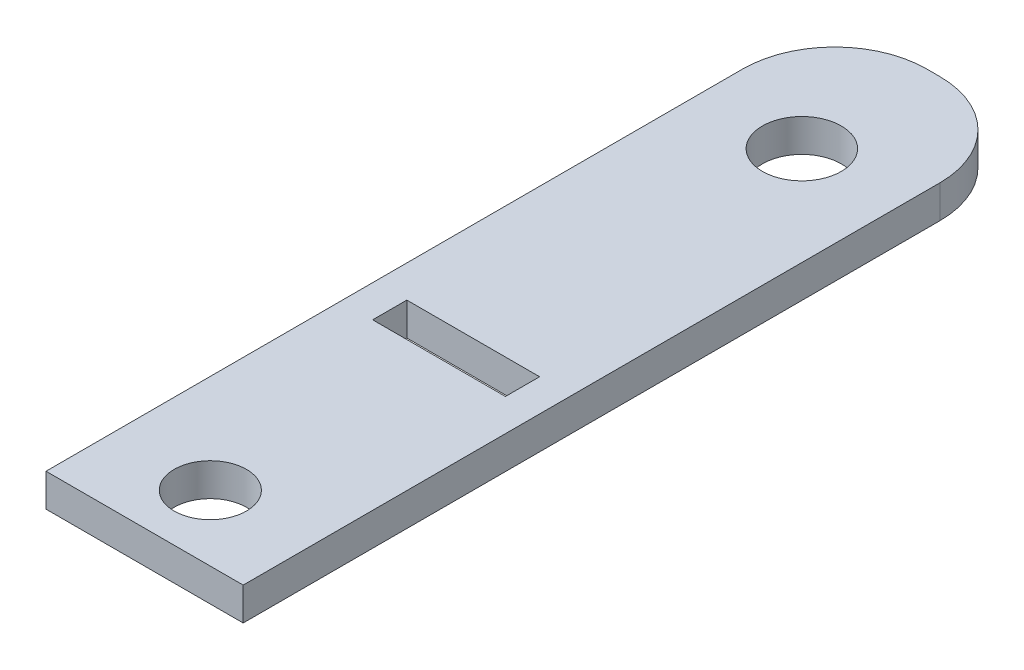
ISO-10303-21;
HEADER;
FILE_DESCRIPTION(('STEP AP214'),'2;1');
FILE_NAME('part.step','',(''),(''),'','','');
FILE_SCHEMA(('AUTOMOTIVE_DESIGN { 1 0 10303 214 1 1 1 1 }'));
ENDSEC;
DATA;
#1=APPLICATION_CONTEXT('core data for automotive mechanical design processes');
#2=APPLICATION_PROTOCOL_DEFINITION('international standard','automotive_design',2000,#1);
#3=PRODUCT_CONTEXT('',#1,'mechanical');
#4=PRODUCT('Part','Part','',(#3));
#5=PRODUCT_RELATED_PRODUCT_CATEGORY('part','',(#4));
#6=PRODUCT_DEFINITION_FORMATION('','',#4);
#7=PRODUCT_DEFINITION_CONTEXT('part definition',#1,'design');
#8=PRODUCT_DEFINITION('design','',#6,#7);
#9=PRODUCT_DEFINITION_SHAPE('','',#8);
#10=(LENGTH_UNIT() NAMED_UNIT(*) SI_UNIT(.MILLI.,.METRE.));
#11=(NAMED_UNIT(*) PLANE_ANGLE_UNIT() SI_UNIT($,.RADIAN.));
#12=(NAMED_UNIT(*) SI_UNIT($,.STERADIAN.) SOLID_ANGLE_UNIT());
#13=UNCERTAINTY_MEASURE_WITH_UNIT(LENGTH_MEASURE(1.E-05),#10,'distance_accuracy_value','');
#14=(GEOMETRIC_REPRESENTATION_CONTEXT(3) GLOBAL_UNCERTAINTY_ASSIGNED_CONTEXT((#13)) GLOBAL_UNIT_ASSIGNED_CONTEXT((#10,
#11,#12)) REPRESENTATION_CONTEXT('',''));
#15=CARTESIAN_POINT('',(0.,0.,0.));
#16=DIRECTION('',(0.,0.,1.));
#17=DIRECTION('',(1.,0.,0.));
#18=AXIS2_PLACEMENT_3D('',#15,#16,#17);
#19=CARTESIAN_POINT('',(-5.52309824012321,-0.0697461828453013,-24.4261845109079));
#20=DIRECTION('',(0.,1.,0.));
#21=DIRECTION('',(0.,0.,1.));
#22=AXIS2_PLACEMENT_3D('',#19,#20,#21);
#23=CYLINDRICAL_SURFACE('',#22,8.89);
#24=DIRECTION('',(0.,1.,0.));
#25=VECTOR('',#24,1.);
#26=CARTESIAN_POINT('',(-5.52309824012321,-0.0697461828453013,-33.3161845109079));
#27=LINE('',#26,#25);
#28=CARTESIAN_POINT('',(-5.52309824012321,-3.2447461828453,-33.3161845109079));
#29=VERTEX_POINT('',#28);
#30=CARTESIAN_POINT('',(-5.52309824012321,-0.0697461828453013,-33.3161845109079));
#31=VERTEX_POINT('',#30);
#32=EDGE_CURVE('E190',#29,#31,#27,.T.);
#33=ORIENTED_EDGE('',*,*,#32,.F.);
#34=CARTESIAN_POINT('',(-5.52309824012321,-3.2447461828453,-24.4261845109079));
#35=DIRECTION('',(0.,1.,0.));
#36=DIRECTION('',(0.,0.,1.));
#37=AXIS2_PLACEMENT_3D('',#34,#35,#36);
#38=CIRCLE('',#37,8.89);
#39=CARTESIAN_POINT('',(-14.4130982401232,-3.2447461828453,-24.4261845109079));
#40=VERTEX_POINT('',#39);
#41=EDGE_CURVE('E39',#40,#29,#38,.F.);
#42=ORIENTED_EDGE('',*,*,#41,.F.);
#43=DIRECTION('',(0.,1.,0.));
#44=VECTOR('',#43,1.);
#45=CARTESIAN_POINT('',(-14.4130982401232,-0.0697461828453013,-24.4261845109079));
#46=LINE('',#45,#44);
#47=CARTESIAN_POINT('',(-14.4130982401232,-0.0697461828453013,-24.4261845109079));
#48=VERTEX_POINT('',#47);
#49=EDGE_CURVE('E193',#48,#40,#46,.F.);
#50=ORIENTED_EDGE('',*,*,#49,.F.);
#51=CARTESIAN_POINT('',(-5.52309824012321,-0.0697461828453013,-24.4261845109079));
#52=DIRECTION('',(0.,1.,0.));
#53=DIRECTION('',(0.,0.,1.));
#54=AXIS2_PLACEMENT_3D('',#51,#52,#53);
#55=CIRCLE('',#54,8.89);
#56=EDGE_CURVE('E11',#31,#48,#55,.T.);
#57=ORIENTED_EDGE('',*,*,#56,.F.);
#58=EDGE_LOOP('',(#33,#42,#50,#57));
#59=FACE_BOUND('',#58,.T.);
#60=ADVANCED_FACE('F32',(#59),#23,.T.);
#61=CARTESIAN_POINT('',(-4.2530982401232,-0.0697461828453013,-24.4261845109079));
#62=DIRECTION('',(0.,1.,0.));
#63=DIRECTION('',(0.,0.,1.));
#64=AXIS2_PLACEMENT_3D('',#61,#62,#63);
#65=CYLINDRICAL_SURFACE('',#64,8.89);
#66=DIRECTION('',(0.,1.,0.));
#67=VECTOR('',#66,1.);
#68=CARTESIAN_POINT('',(4.6369017598768,-0.0697461828453013,-24.4261845109079));
#69=LINE('',#68,#67);
#70=CARTESIAN_POINT('',(4.6369017598768,-3.2447461828453,-24.4261845109079));
#71=VERTEX_POINT('',#70);
#72=CARTESIAN_POINT('',(4.6369017598768,-0.0697461828453013,-24.4261845109079));
#73=VERTEX_POINT('',#72);
#74=EDGE_CURVE('E180',#71,#73,#69,.T.);
#75=ORIENTED_EDGE('',*,*,#74,.F.);
#76=CARTESIAN_POINT('',(-4.2530982401232,-3.2447461828453,-24.4261845109079));
#77=DIRECTION('',(0.,1.,0.));
#78=DIRECTION('',(0.,0.,1.));
#79=AXIS2_PLACEMENT_3D('',#76,#77,#78);
#80=CIRCLE('',#79,8.89);
#81=CARTESIAN_POINT('',(-4.25309824012321,-3.2447461828453,-33.3161845109079));
#82=VERTEX_POINT('',#81);
#83=EDGE_CURVE('E186',#82,#71,#80,.F.);
#84=ORIENTED_EDGE('',*,*,#83,.F.);
#85=DIRECTION('',(0.,1.,0.));
#86=VECTOR('',#85,1.);
#87=CARTESIAN_POINT('',(-4.2530982401232,-0.0697461828453013,-33.3161845109079));
#88=LINE('',#87,#86);
#89=CARTESIAN_POINT('',(-4.25309824012321,-0.0697461828453013,-33.3161845109079));
#90=VERTEX_POINT('',#89);
#91=EDGE_CURVE('E183',#90,#82,#88,.F.);
#92=ORIENTED_EDGE('',*,*,#91,.F.);
#93=CARTESIAN_POINT('',(-4.2530982401232,-0.0697461828453013,-24.4261845109079));
#94=DIRECTION('',(0.,1.,0.));
#95=DIRECTION('',(0.,0.,1.));
#96=AXIS2_PLACEMENT_3D('',#93,#94,#95);
#97=CIRCLE('',#96,8.89);
#98=EDGE_CURVE('E188',#73,#90,#97,.T.);
#99=ORIENTED_EDGE('',*,*,#98,.F.);
#100=EDGE_LOOP('',(#75,#84,#92,#99));
#101=FACE_BOUND('',#100,.T.);
#102=ADVANCED_FACE('F206',(#101),#65,.T.);
#103=CARTESIAN_POINT('',(-4.88809824012321,-0.0697461828453013,4.78381548909214));
#104=DIRECTION('',(0.,1.,0.));
#105=DIRECTION('',(0.,0.,1.));
#106=AXIS2_PLACEMENT_3D('',#103,#104,#105);
#107=PLANE('',#106);
#108=CARTESIAN_POINT('',(-4.8880982401232,-0.0697461828453013,36.5338154890921));
#109=DIRECTION('',(0.,1.,0.));
#110=DIRECTION('',(0.,0.,1.));
#111=AXIS2_PLACEMENT_3D('',#108,#109,#110);
#112=CIRCLE('',#111,3.4925);
#113=CARTESIAN_POINT('',(-4.8880982401232,-0.0697461828453013,40.0263154890921));
#114=VERTEX_POINT('',#113);
#115=EDGE_CURVE('E345',#114,#114,#112,.T.);
#116=ORIENTED_EDGE('',*,*,#115,.F.);
#117=EDGE_LOOP('',(#116));
#118=FACE_BOUND('',#117,.T.);
#119=CARTESIAN_POINT('',(-4.88809824012321,-0.0697461828453013,-20.6161845109079));
#120=DIRECTION('',(0.,1.,0.));
#121=DIRECTION('',(0.,0.,1.));
#122=AXIS2_PLACEMENT_3D('',#119,#120,#121);
#123=CIRCLE('',#122,3.81);
#124=CARTESIAN_POINT('',(-4.88809824012321,-0.0697461828453013,-16.8061845109079));
#125=VERTEX_POINT('',#124);
#126=EDGE_CURVE('E150',#125,#125,#123,.T.);
#127=ORIENTED_EDGE('',*,*,#126,.F.);
#128=EDGE_LOOP('',(#127));
#129=FACE_BOUND('',#128,.T.);
#130=DIRECTION('',(-1.,0.,0.));
#131=VECTOR('',#130,1.);
#132=CARTESIAN_POINT('',(-14.4130982401232,-0.0697461828453013,-33.3161845109079));
#133=LINE('',#132,#131);
#134=EDGE_CURVE('E164',#90,#31,#133,.T.);
#135=ORIENTED_EDGE('',*,*,#134,.T.);
#136=ORIENTED_EDGE('',*,*,#56,.T.);
#137=DIRECTION('',(0.,0.,1.));
#138=VECTOR('',#137,1.);
#139=CARTESIAN_POINT('',(-14.4130982401232,-0.0697461828453013,-33.3161845109079));
#140=LINE('',#139,#138);
#141=CARTESIAN_POINT('',(-14.4130982401232,-0.0697461828453013,42.8838154890921));
#142=VERTEX_POINT('',#141);
#143=EDGE_CURVE('E156',#48,#142,#140,.T.);
#144=ORIENTED_EDGE('',*,*,#143,.T.);
#145=DIRECTION('',(1.,0.,0.));
#146=VECTOR('',#145,1.);
#147=CARTESIAN_POINT('',(-14.4130982401232,-0.0697461828453013,42.8838154890921));
#148=LINE('',#147,#146);
#149=CARTESIAN_POINT('',(4.6369017598768,-0.0697461828453013,42.8838154890921));
#150=VERTEX_POINT('',#149);
#151=EDGE_CURVE('E158',#142,#150,#148,.T.);
#152=ORIENTED_EDGE('',*,*,#151,.T.);
#153=DIRECTION('',(0.,0.,-1.));
#154=VECTOR('',#153,1.);
#155=CARTESIAN_POINT('',(4.6369017598768,-0.0697461828453013,-33.3161845109079));
#156=LINE('',#155,#154);
#157=EDGE_CURVE('E161',#150,#73,#156,.T.);
#158=ORIENTED_EDGE('',*,*,#157,.T.);
#159=ORIENTED_EDGE('',*,*,#98,.T.);
#160=EDGE_LOOP('',(#135,#136,#144,#152,#158,#159));
#161=FACE_BOUND('',#160,.T.);
#162=DIRECTION('',(1.,0.,0.));
#163=VECTOR('',#162,1.);
#164=CARTESIAN_POINT('',(-11.3015982401232,-0.0697461828453013,14.4358154890921));
#165=LINE('',#164,#163);
#166=CARTESIAN_POINT('',(-11.3015982401232,-0.0697461828453013,14.4358154890921));
#167=VERTEX_POINT('',#166);
#168=CARTESIAN_POINT('',(1.52540175987679,-0.0697461828453013,14.4358154890921));
#169=VERTEX_POINT('',#168);
#170=EDGE_CURVE('E116',#167,#169,#165,.T.);
#171=ORIENTED_EDGE('',*,*,#170,.F.);
#172=DIRECTION('',(0.,0.,1.));
#173=VECTOR('',#172,1.);
#174=CARTESIAN_POINT('',(-11.3015982401232,-0.0697461828453013,11.1338154890921));
#175=LINE('',#174,#173);
#176=CARTESIAN_POINT('',(-11.3015982401232,-0.0697461828453013,11.1338154890921));
#177=VERTEX_POINT('',#176);
#178=EDGE_CURVE('E106',#177,#167,#175,.T.);
#179=ORIENTED_EDGE('',*,*,#178,.F.);
#180=DIRECTION('',(-1.,0.,0.));
#181=VECTOR('',#180,1.);
#182=CARTESIAN_POINT('',(-11.3015982401232,-0.0697461828453013,11.1338154890921));
#183=LINE('',#182,#181);
#184=CARTESIAN_POINT('',(1.52540175987679,-0.0697461828453013,11.1338154890921));
#185=VERTEX_POINT('',#184);
#186=EDGE_CURVE('E132',#185,#177,#183,.T.);
#187=ORIENTED_EDGE('',*,*,#186,.F.);
#188=DIRECTION('',(0.,0.,-1.));
#189=VECTOR('',#188,1.);
#190=CARTESIAN_POINT('',(1.52540175987679,-0.0697461828453013,11.1338154890921));
#191=LINE('',#190,#189);
#192=EDGE_CURVE('E130',#169,#185,#191,.T.);
#193=ORIENTED_EDGE('',*,*,#192,.F.);
#194=EDGE_LOOP('',(#171,#179,#187,#193));
#195=FACE_BOUND('',#194,.T.);
#196=ADVANCED_FACE('F128',(#118,#129,#161,#195),#107,.T.);
#197=CARTESIAN_POINT('',(-4.88809824012321,-3.2447461828453,4.78381548909214));
#198=DIRECTION('',(0.,1.,0.));
#199=DIRECTION('',(0.,0.,1.));
#200=AXIS2_PLACEMENT_3D('',#197,#198,#199);
#201=PLANE('',#200);
#202=CARTESIAN_POINT('',(-4.8880982401232,-3.2447461828453,36.5338154890921));
#203=DIRECTION('',(0.,1.,0.));
#204=DIRECTION('',(0.,0.,1.));
#205=AXIS2_PLACEMENT_3D('',#202,#203,#204);
#206=CIRCLE('',#205,3.4925);
#207=CARTESIAN_POINT('',(-4.8880982401232,-3.2447461828453,40.0263154890921));
#208=VERTEX_POINT('',#207);
#209=EDGE_CURVE('E139',#208,#208,#206,.T.);
#210=ORIENTED_EDGE('',*,*,#209,.T.);
#211=EDGE_LOOP('',(#210));
#212=FACE_BOUND('',#211,.T.);
#213=CARTESIAN_POINT('',(-4.88809824012321,-3.2447461828453,-20.6161845109079));
#214=DIRECTION('',(0.,1.,0.));
#215=DIRECTION('',(0.,0.,1.));
#216=AXIS2_PLACEMENT_3D('',#213,#214,#215);
#217=CIRCLE('',#216,3.81);
#218=CARTESIAN_POINT('',(-4.88809824012321,-3.2447461828453,-16.8061845109079));
#219=VERTEX_POINT('',#218);
#220=EDGE_CURVE('E124',#219,#219,#217,.T.);
#221=ORIENTED_EDGE('',*,*,#220,.T.);
#222=EDGE_LOOP('',(#221));
#223=FACE_BOUND('',#222,.T.);
#224=DIRECTION('',(0.,0.,1.));
#225=VECTOR('',#224,1.);
#226=CARTESIAN_POINT('',(-14.4130982401232,-3.2447461828453,-33.3161845109079));
#227=LINE('',#226,#225);
#228=CARTESIAN_POINT('',(-14.4130982401232,-3.2447461828453,42.8838154890921));
#229=VERTEX_POINT('',#228);
#230=EDGE_CURVE('E153',#40,#229,#227,.T.);
#231=ORIENTED_EDGE('',*,*,#230,.F.);
#232=ORIENTED_EDGE('',*,*,#41,.T.);
#233=DIRECTION('',(-1.,0.,0.));
#234=VECTOR('',#233,1.);
#235=CARTESIAN_POINT('',(-14.4130982401232,-3.2447461828453,-33.3161845109079));
#236=LINE('',#235,#234);
#237=EDGE_CURVE('E159',#82,#29,#236,.T.);
#238=ORIENTED_EDGE('',*,*,#237,.F.);
#239=ORIENTED_EDGE('',*,*,#83,.T.);
#240=DIRECTION('',(0.,0.,-1.));
#241=VECTOR('',#240,1.);
#242=CARTESIAN_POINT('',(4.6369017598768,-3.2447461828453,-33.3161845109079));
#243=LINE('',#242,#241);
#244=CARTESIAN_POINT('',(4.6369017598768,-3.2447461828453,42.8838154890921));
#245=VERTEX_POINT('',#244);
#246=EDGE_CURVE('E170',#245,#71,#243,.T.);
#247=ORIENTED_EDGE('',*,*,#246,.F.);
#248=DIRECTION('',(1.,0.,0.));
#249=VECTOR('',#248,1.);
#250=CARTESIAN_POINT('',(-14.4130982401232,-3.2447461828453,42.8838154890921));
#251=LINE('',#250,#249);
#252=EDGE_CURVE('E168',#229,#245,#251,.T.);
#253=ORIENTED_EDGE('',*,*,#252,.F.);
#254=EDGE_LOOP('',(#231,#232,#238,#239,#247,#253));
#255=FACE_BOUND('',#254,.T.);
#256=DIRECTION('',(0.,0.,1.));
#257=VECTOR('',#256,1.);
#258=CARTESIAN_POINT('',(-11.3015982401232,-3.2447461828453,11.1338154890921));
#259=LINE('',#258,#257);
#260=CARTESIAN_POINT('',(-11.3015982401232,-3.2447461828453,11.1338154890921));
#261=VERTEX_POINT('',#260);
#262=CARTESIAN_POINT('',(-11.3015982401232,-3.2447461828453,14.4358154890921));
#263=VERTEX_POINT('',#262);
#264=EDGE_CURVE('E137',#261,#263,#259,.T.);
#265=ORIENTED_EDGE('',*,*,#264,.T.);
#266=DIRECTION('',(1.,0.,0.));
#267=VECTOR('',#266,1.);
#268=CARTESIAN_POINT('',(-11.3015982401232,-3.2447461828453,14.4358154890921));
#269=LINE('',#268,#267);
#270=CARTESIAN_POINT('',(1.52540175987679,-3.2447461828453,14.4358154890921));
#271=VERTEX_POINT('',#270);
#272=EDGE_CURVE('E123',#263,#271,#269,.T.);
#273=ORIENTED_EDGE('',*,*,#272,.T.);
#274=DIRECTION('',(0.,0.,-1.));
#275=VECTOR('',#274,1.);
#276=CARTESIAN_POINT('',(1.52540175987679,-3.2447461828453,11.1338154890921));
#277=LINE('',#276,#275);
#278=CARTESIAN_POINT('',(1.52540175987679,-3.2447461828453,11.1338154890921));
#279=VERTEX_POINT('',#278);
#280=EDGE_CURVE('E141',#271,#279,#277,.T.);
#281=ORIENTED_EDGE('',*,*,#280,.T.);
#282=DIRECTION('',(-1.,0.,0.));
#283=VECTOR('',#282,1.);
#284=CARTESIAN_POINT('',(-11.3015982401232,-3.2447461828453,11.1338154890921));
#285=LINE('',#284,#283);
#286=EDGE_CURVE('E117',#279,#261,#285,.T.);
#287=ORIENTED_EDGE('',*,*,#286,.T.);
#288=EDGE_LOOP('',(#265,#273,#281,#287));
#289=FACE_BOUND('',#288,.T.);
#290=ADVANCED_FACE('F197',(#212,#223,#255,#289),#201,.F.);
#291=CARTESIAN_POINT('',(-14.4130982401232,-0.0697461828453013,-33.3161845109079));
#292=DIRECTION('',(1.,0.,0.));
#293=DIRECTION('',(0.,0.,-1.));
#294=AXIS2_PLACEMENT_3D('',#291,#292,#293);
#295=PLANE('',#294);
#296=ORIENTED_EDGE('',*,*,#143,.F.);
#297=ORIENTED_EDGE('',*,*,#49,.T.);
#298=ORIENTED_EDGE('',*,*,#230,.T.);
#299=DIRECTION('',(0.,-1.,0.));
#300=VECTOR('',#299,1.);
#301=CARTESIAN_POINT('',(-14.4130982401232,-0.0697461828453013,42.8838154890921));
#302=LINE('',#301,#300);
#303=EDGE_CURVE('E177',#142,#229,#302,.T.);
#304=ORIENTED_EDGE('',*,*,#303,.F.);
#305=EDGE_LOOP('',(#296,#297,#298,#304));
#306=FACE_BOUND('',#305,.T.);
#307=ADVANCED_FACE('F218',(#306),#295,.F.);
#308=CARTESIAN_POINT('',(-14.4130982401232,-0.0697461828453013,42.8838154890921));
#309=DIRECTION('',(0.,0.,-1.));
#310=DIRECTION('',(-1.,0.,0.));
#311=AXIS2_PLACEMENT_3D('',#308,#309,#310);
#312=PLANE('',#311);
#313=ORIENTED_EDGE('',*,*,#252,.T.);
#314=DIRECTION('',(0.,-1.,0.));
#315=VECTOR('',#314,1.);
#316=CARTESIAN_POINT('',(4.6369017598768,-0.0697461828453013,42.8838154890921));
#317=LINE('',#316,#315);
#318=EDGE_CURVE('E166',#150,#245,#317,.T.);
#319=ORIENTED_EDGE('',*,*,#318,.F.);
#320=ORIENTED_EDGE('',*,*,#151,.F.);
#321=ORIENTED_EDGE('',*,*,#303,.T.);
#322=EDGE_LOOP('',(#313,#319,#320,#321));
#323=FACE_BOUND('',#322,.T.);
#324=ADVANCED_FACE('F214',(#323),#312,.F.);
#325=CARTESIAN_POINT('',(4.6369017598768,-0.0697461828453013,-33.3161845109079));
#326=DIRECTION('',(-1.,0.,0.));
#327=DIRECTION('',(0.,0.,1.));
#328=AXIS2_PLACEMENT_3D('',#325,#326,#327);
#329=PLANE('',#328);
#330=ORIENTED_EDGE('',*,*,#246,.T.);
#331=ORIENTED_EDGE('',*,*,#74,.T.);
#332=ORIENTED_EDGE('',*,*,#157,.F.);
#333=ORIENTED_EDGE('',*,*,#318,.T.);
#334=EDGE_LOOP('',(#330,#331,#332,#333));
#335=FACE_BOUND('',#334,.T.);
#336=ADVANCED_FACE('F209',(#335),#329,.F.);
#337=CARTESIAN_POINT('',(-14.4130982401232,-0.0697461828453013,-33.3161845109079));
#338=DIRECTION('',(0.,0.,1.));
#339=DIRECTION('',(1.,0.,0.));
#340=AXIS2_PLACEMENT_3D('',#337,#338,#339);
#341=PLANE('',#340);
#342=ORIENTED_EDGE('',*,*,#237,.T.);
#343=ORIENTED_EDGE('',*,*,#32,.T.);
#344=ORIENTED_EDGE('',*,*,#134,.F.);
#345=ORIENTED_EDGE('',*,*,#91,.T.);
#346=EDGE_LOOP('',(#342,#343,#344,#345));
#347=FACE_BOUND('',#346,.T.);
#348=ADVANCED_FACE('F202',(#347),#341,.F.);
#349=CARTESIAN_POINT('',(-4.88809824012321,-0.0697461828453013,-20.6161845109079));
#350=DIRECTION('',(0.,-1.,0.));
#351=DIRECTION('',(0.,0.,-1.));
#352=AXIS2_PLACEMENT_3D('',#349,#350,#351);
#353=CYLINDRICAL_SURFACE('',#352,3.81);
#354=ORIENTED_EDGE('',*,*,#126,.T.);
#355=EDGE_LOOP('',(#354));
#356=FACE_BOUND('',#355,.T.);
#357=ORIENTED_EDGE('',*,*,#220,.F.);
#358=EDGE_LOOP('',(#357));
#359=FACE_BOUND('',#358,.T.);
#360=ADVANCED_FACE('F269',(#356,#359),#353,.F.);
#361=CARTESIAN_POINT('',(-11.3015982401232,-0.0697461828453013,11.1338154890921));
#362=DIRECTION('',(1.,0.,0.));
#363=DIRECTION('',(0.,0.,-1.));
#364=AXIS2_PLACEMENT_3D('',#361,#362,#363);
#365=PLANE('',#364);
#366=ORIENTED_EDGE('',*,*,#264,.F.);
#367=DIRECTION('',(0.,-1.,0.));
#368=VECTOR('',#367,1.);
#369=CARTESIAN_POINT('',(-11.3015982401232,-0.0697461828453013,11.1338154890921));
#370=LINE('',#369,#368);
#371=EDGE_CURVE('E112',#177,#261,#370,.T.);
#372=ORIENTED_EDGE('',*,*,#371,.F.);
#373=ORIENTED_EDGE('',*,*,#178,.T.);
#374=DIRECTION('',(0.,-1.,0.));
#375=VECTOR('',#374,1.);
#376=CARTESIAN_POINT('',(-11.3015982401232,-0.0697461828453013,14.4358154890921));
#377=LINE('',#376,#375);
#378=EDGE_CURVE('E109',#167,#263,#377,.T.);
#379=ORIENTED_EDGE('',*,*,#378,.T.);
#380=EDGE_LOOP('',(#366,#372,#373,#379));
#381=FACE_BOUND('',#380,.T.);
#382=ADVANCED_FACE('F108',(#381),#365,.T.);
#383=CARTESIAN_POINT('',(-11.3015982401232,-0.0697461828453013,14.4358154890921));
#384=DIRECTION('',(0.,0.,-1.));
#385=DIRECTION('',(-1.,0.,0.));
#386=AXIS2_PLACEMENT_3D('',#383,#384,#385);
#387=PLANE('',#386);
#388=ORIENTED_EDGE('',*,*,#272,.F.);
#389=ORIENTED_EDGE('',*,*,#378,.F.);
#390=ORIENTED_EDGE('',*,*,#170,.T.);
#391=DIRECTION('',(0.,-1.,0.));
#392=VECTOR('',#391,1.);
#393=CARTESIAN_POINT('',(1.52540175987679,-0.0697461828453013,14.4358154890921));
#394=LINE('',#393,#392);
#395=EDGE_CURVE('E125',#169,#271,#394,.T.);
#396=ORIENTED_EDGE('',*,*,#395,.T.);
#397=EDGE_LOOP('',(#388,#389,#390,#396));
#398=FACE_BOUND('',#397,.T.);
#399=ADVANCED_FACE('F120',(#398),#387,.T.);
#400=CARTESIAN_POINT('',(1.52540175987679,-0.0697461828453013,11.1338154890921));
#401=DIRECTION('',(-1.,0.,0.));
#402=DIRECTION('',(0.,0.,1.));
#403=AXIS2_PLACEMENT_3D('',#400,#401,#402);
#404=PLANE('',#403);
#405=ORIENTED_EDGE('',*,*,#280,.F.);
#406=ORIENTED_EDGE('',*,*,#395,.F.);
#407=ORIENTED_EDGE('',*,*,#192,.T.);
#408=DIRECTION('',(0.,-1.,0.));
#409=VECTOR('',#408,1.);
#410=CARTESIAN_POINT('',(1.52540175987679,-0.0697461828453013,11.1338154890921));
#411=LINE('',#410,#409);
#412=EDGE_CURVE('E147',#185,#279,#411,.T.);
#413=ORIENTED_EDGE('',*,*,#412,.T.);
#414=EDGE_LOOP('',(#405,#406,#407,#413));
#415=FACE_BOUND('',#414,.T.);
#416=ADVANCED_FACE('F291',(#415),#404,.T.);
#417=CARTESIAN_POINT('',(-11.3015982401232,-0.0697461828453013,11.1338154890921));
#418=DIRECTION('',(0.,0.,1.));
#419=DIRECTION('',(1.,0.,0.));
#420=AXIS2_PLACEMENT_3D('',#417,#418,#419);
#421=PLANE('',#420);
#422=ORIENTED_EDGE('',*,*,#286,.F.);
#423=ORIENTED_EDGE('',*,*,#412,.F.);
#424=ORIENTED_EDGE('',*,*,#186,.T.);
#425=ORIENTED_EDGE('',*,*,#371,.T.);
#426=EDGE_LOOP('',(#422,#423,#424,#425));
#427=FACE_BOUND('',#426,.T.);
#428=ADVANCED_FACE('F298',(#427),#421,.T.);
#429=CARTESIAN_POINT('',(-4.8880982401232,-3.2447461828453,36.5338154890921));
#430=DIRECTION('',(0.,1.,0.));
#431=DIRECTION('',(0.,0.,1.));
#432=AXIS2_PLACEMENT_3D('',#429,#430,#431);
#433=CYLINDRICAL_SURFACE('',#432,3.4925);
#434=ORIENTED_EDGE('',*,*,#209,.F.);
#435=EDGE_LOOP('',(#434));
#436=FACE_BOUND('',#435,.T.);
#437=ORIENTED_EDGE('',*,*,#115,.T.);
#438=EDGE_LOOP('',(#437));
#439=FACE_BOUND('',#438,.T.);
#440=ADVANCED_FACE('F306',(#436,#439),#433,.F.);
#441=CLOSED_SHELL('',(#60,#102,#196,#290,#307,#324,#336,#348,#360,#382,#399,#416,#428,#440));
#442=MANIFOLD_SOLID_BREP('B2',#441);
#443=ADVANCED_BREP_SHAPE_REPRESENTATION('',(#18,#442),#14);
#444=SHAPE_DEFINITION_REPRESENTATION(#9,#443);
ENDSEC;
END-ISO-10303-21;
